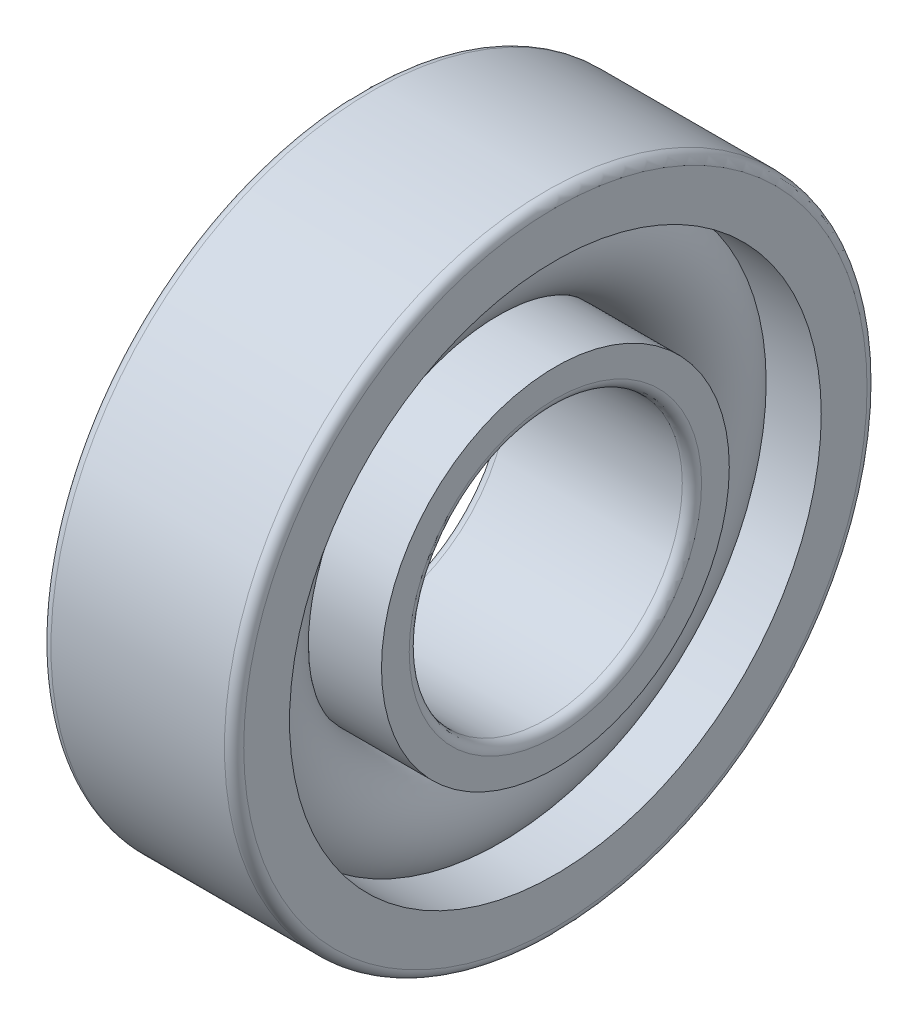
ISO-10303-21;
HEADER;
FILE_DESCRIPTION(('STEP AP214'),'2;1');
FILE_NAME('part.step','',(''),(''),'','','');
FILE_SCHEMA(('AUTOMOTIVE_DESIGN { 1 0 10303 214 1 1 1 1 }'));
ENDSEC;
DATA;
#1=APPLICATION_CONTEXT('core data for automotive mechanical design processes');
#2=APPLICATION_PROTOCOL_DEFINITION('international standard','automotive_design',2000,#1);
#3=PRODUCT_CONTEXT('',#1,'mechanical');
#4=PRODUCT('Part','Part','',(#3));
#5=PRODUCT_RELATED_PRODUCT_CATEGORY('part','',(#4));
#6=PRODUCT_DEFINITION_FORMATION('','',#4);
#7=PRODUCT_DEFINITION_CONTEXT('part definition',#1,'design');
#8=PRODUCT_DEFINITION('design','',#6,#7);
#9=PRODUCT_DEFINITION_SHAPE('','',#8);
#10=(LENGTH_UNIT() NAMED_UNIT(*) SI_UNIT(.MILLI.,.METRE.));
#11=(NAMED_UNIT(*) PLANE_ANGLE_UNIT() SI_UNIT($,.RADIAN.));
#12=(NAMED_UNIT(*) SI_UNIT($,.STERADIAN.) SOLID_ANGLE_UNIT());
#13=UNCERTAINTY_MEASURE_WITH_UNIT(LENGTH_MEASURE(1.E-05),#10,'distance_accuracy_value','');
#14=(GEOMETRIC_REPRESENTATION_CONTEXT(3) GLOBAL_UNCERTAINTY_ASSIGNED_CONTEXT((#13)) GLOBAL_UNIT_ASSIGNED_CONTEXT((#10,
#11,#12)) REPRESENTATION_CONTEXT('',''));
#15=CARTESIAN_POINT('',(0.,0.,0.));
#16=DIRECTION('',(0.,0.,1.));
#17=DIRECTION('',(1.,0.,0.));
#18=AXIS2_PLACEMENT_3D('',#15,#16,#17);
#19=CARTESIAN_POINT('',(0.,0.,0.));
#20=DIRECTION('',(-1.,0.,0.));
#21=DIRECTION('',(0.,0.,1.));
#22=AXIS2_PLACEMENT_3D('',#19,#20,#21);
#23=TOROIDAL_SURFACE('',#22,14.25,3.45);
#24=CARTESIAN_POINT('',(2.57147817412476,0.,0.));
#25=DIRECTION('',(-1.,0.,0.));
#26=DIRECTION('',(0.,0.,1.));
#27=AXIS2_PLACEMENT_3D('',#24,#25,#26);
#28=CIRCLE('',#27,16.55);
#29=CARTESIAN_POINT('',(2.57147817412476,0.,16.55));
#30=VERTEX_POINT('',#29);
#31=EDGE_CURVE('E35',#30,#30,#28,.F.);
#32=ORIENTED_EDGE('',*,*,#31,.T.);
#33=EDGE_LOOP('',(#32));
#34=FACE_BOUND('',#33,.T.);
#35=CARTESIAN_POINT('',(0.414578098794436,0.,0.));
#36=DIRECTION('',(-1.,0.,0.));
#37=DIRECTION('',(0.,0.,1.));
#38=AXIS2_PLACEMENT_3D('',#35,#36,#37);
#39=CIRCLE('',#38,10.825);
#40=CARTESIAN_POINT('',(0.414578098794436,0.,10.825));
#41=VERTEX_POINT('',#40);
#42=EDGE_CURVE('E10',#41,#41,#39,.T.);
#43=ORIENTED_EDGE('',*,*,#42,.T.);
#44=EDGE_LOOP('',(#43));
#45=FACE_BOUND('',#44,.T.);
#46=ADVANCED_FACE('F31',(#34,#45),#23,.T.);
#47=CARTESIAN_POINT('',(-20.6375,0.,0.));
#48=DIRECTION('',(1.,0.,0.));
#49=DIRECTION('',(0.,0.,-1.));
#50=AXIS2_PLACEMENT_3D('',#47,#48,#49);
#51=CYLINDRICAL_SURFACE('',#50,10.825);
#52=CARTESIAN_POINT('',(6.,0.,0.));
#53=DIRECTION('',(1.,0.,0.));
#54=DIRECTION('',(0.,0.,-1.));
#55=AXIS2_PLACEMENT_3D('',#52,#53,#54);
#56=CIRCLE('',#55,10.825);
#57=CARTESIAN_POINT('',(6.,0.,-10.825));
#58=VERTEX_POINT('',#57);
#59=EDGE_CURVE('E44',#58,#58,#56,.T.);
#60=ORIENTED_EDGE('',*,*,#59,.F.);
#61=EDGE_LOOP('',(#60));
#62=FACE_BOUND('',#61,.T.);
#63=ORIENTED_EDGE('',*,*,#42,.F.);
#64=EDGE_LOOP('',(#63));
#65=FACE_BOUND('',#64,.T.);
#66=ADVANCED_FACE('F83',(#62,#65),#51,.T.);
#67=CARTESIAN_POINT('',(-20.6375,0.,0.));
#68=DIRECTION('',(1.,0.,0.));
#69=DIRECTION('',(0.,0.,-1.));
#70=AXIS2_PLACEMENT_3D('',#67,#68,#69);
#71=CYLINDRICAL_SURFACE('',#70,11.95);
#72=CARTESIAN_POINT('',(-6.,0.,0.));
#73=DIRECTION('',(1.,0.,0.));
#74=DIRECTION('',(0.,0.,-1.));
#75=AXIS2_PLACEMENT_3D('',#72,#73,#74);
#76=CIRCLE('',#75,11.95);
#77=CARTESIAN_POINT('',(-6.,0.,-11.95));
#78=VERTEX_POINT('',#77);
#79=EDGE_CURVE('E53',#78,#78,#76,.T.);
#80=ORIENTED_EDGE('',*,*,#79,.T.);
#81=EDGE_LOOP('',(#80));
#82=FACE_BOUND('',#81,.T.);
#83=CARTESIAN_POINT('',(-2.57147817412476,0.,0.));
#84=DIRECTION('',(1.,0.,0.));
#85=DIRECTION('',(0.,0.,-1.));
#86=AXIS2_PLACEMENT_3D('',#83,#84,#85);
#87=CIRCLE('',#86,11.95);
#88=CARTESIAN_POINT('',(-2.57147817412476,0.,-11.95));
#89=VERTEX_POINT('',#88);
#90=EDGE_CURVE('E39',#89,#89,#87,.T.);
#91=ORIENTED_EDGE('',*,*,#90,.F.);
#92=EDGE_LOOP('',(#91));
#93=FACE_BOUND('',#92,.T.);
#94=ADVANCED_FACE('F86',(#82,#93),#71,.T.);
#95=CARTESIAN_POINT('',(6.,9.1,0.));
#96=DIRECTION('',(1.,0.,0.));
#97=DIRECTION('',(0.,0.,-1.));
#98=AXIS2_PLACEMENT_3D('',#95,#96,#97);
#99=PLANE('',#98);
#100=ORIENTED_EDGE('',*,*,#59,.T.);
#101=EDGE_LOOP('',(#100));
#102=FACE_BOUND('',#101,.T.);
#103=CARTESIAN_POINT('',(6.,0.,0.));
#104=DIRECTION('',(1.,0.,0.));
#105=DIRECTION('',(0.,0.,-1.));
#106=AXIS2_PLACEMENT_3D('',#103,#104,#105);
#107=CIRCLE('',#106,9.1);
#108=CARTESIAN_POINT('',(6.,0.,-9.1));
#109=VERTEX_POINT('',#108);
#110=EDGE_CURVE('E75',#109,#109,#107,.T.);
#111=ORIENTED_EDGE('',*,*,#110,.F.);
#112=EDGE_LOOP('',(#111));
#113=FACE_BOUND('',#112,.T.);
#114=ADVANCED_FACE('F80',(#102,#113),#99,.T.);
#115=CARTESIAN_POINT('',(5.4,0.,0.));
#116=DIRECTION('',(1.,0.,0.));
#117=DIRECTION('',(0.,0.,-1.));
#118=AXIS2_PLACEMENT_3D('',#115,#116,#117);
#119=TOROIDAL_SURFACE('',#118,9.1,0.6);
#120=ORIENTED_EDGE('',*,*,#110,.T.);
#121=EDGE_LOOP('',(#120));
#122=FACE_BOUND('',#121,.T.);
#123=CARTESIAN_POINT('',(5.4,0.,0.));
#124=DIRECTION('',(1.,0.,0.));
#125=DIRECTION('',(0.,0.,-1.));
#126=AXIS2_PLACEMENT_3D('',#123,#124,#125);
#127=CIRCLE('',#126,8.5);
#128=CARTESIAN_POINT('',(5.4,0.,-8.5));
#129=VERTEX_POINT('',#128);
#130=EDGE_CURVE('E72',#129,#129,#127,.T.);
#131=ORIENTED_EDGE('',*,*,#130,.F.);
#132=EDGE_LOOP('',(#131));
#133=FACE_BOUND('',#132,.T.);
#134=ADVANCED_FACE('F97',(#122,#133),#119,.T.);
#135=CARTESIAN_POINT('',(-20.6375,0.,0.));
#136=DIRECTION('',(1.,0.,0.));
#137=DIRECTION('',(0.,0.,-1.));
#138=AXIS2_PLACEMENT_3D('',#135,#136,#137);
#139=CYLINDRICAL_SURFACE('',#138,8.5);
#140=ORIENTED_EDGE('',*,*,#130,.T.);
#141=EDGE_LOOP('',(#140));
#142=FACE_BOUND('',#141,.T.);
#143=CARTESIAN_POINT('',(-5.4,0.,0.));
#144=DIRECTION('',(1.,0.,0.));
#145=DIRECTION('',(0.,0.,-1.));
#146=AXIS2_PLACEMENT_3D('',#143,#144,#145);
#147=CIRCLE('',#146,8.5);
#148=CARTESIAN_POINT('',(-5.4,0.,-8.5));
#149=VERTEX_POINT('',#148);
#150=EDGE_CURVE('E69',#149,#149,#147,.T.);
#151=ORIENTED_EDGE('',*,*,#150,.F.);
#152=EDGE_LOOP('',(#151));
#153=FACE_BOUND('',#152,.T.);
#154=ADVANCED_FACE('F100',(#142,#153),#139,.F.);
#155=CARTESIAN_POINT('',(-5.4,0.,0.));
#156=DIRECTION('',(1.,0.,0.));
#157=DIRECTION('',(0.,0.,-1.));
#158=AXIS2_PLACEMENT_3D('',#155,#156,#157);
#159=TOROIDAL_SURFACE('',#158,9.1,0.6);
#160=ORIENTED_EDGE('',*,*,#150,.T.);
#161=EDGE_LOOP('',(#160));
#162=FACE_BOUND('',#161,.T.);
#163=CARTESIAN_POINT('',(-6.,0.,0.));
#164=DIRECTION('',(1.,0.,0.));
#165=DIRECTION('',(0.,0.,-1.));
#166=AXIS2_PLACEMENT_3D('',#163,#164,#165);
#167=CIRCLE('',#166,9.1);
#168=CARTESIAN_POINT('',(-6.,0.,-9.1));
#169=VERTEX_POINT('',#168);
#170=EDGE_CURVE('E66',#169,#169,#167,.T.);
#171=ORIENTED_EDGE('',*,*,#170,.F.);
#172=EDGE_LOOP('',(#171));
#173=FACE_BOUND('',#172,.T.);
#174=ADVANCED_FACE('F104',(#162,#173),#159,.T.);
#175=CARTESIAN_POINT('',(-6.,11.95,0.));
#176=DIRECTION('',(-1.,0.,0.));
#177=DIRECTION('',(0.,0.,1.));
#178=AXIS2_PLACEMENT_3D('',#175,#176,#177);
#179=PLANE('',#178);
#180=ORIENTED_EDGE('',*,*,#170,.T.);
#181=EDGE_LOOP('',(#180));
#182=FACE_BOUND('',#181,.T.);
#183=ORIENTED_EDGE('',*,*,#79,.F.);
#184=EDGE_LOOP('',(#183));
#185=FACE_BOUND('',#184,.T.);
#186=ADVANCED_FACE('F108',(#182,#185),#179,.T.);
#187=CARTESIAN_POINT('',(-0.414578098794422,0.,0.));
#188=DIRECTION('',(1.,0.,0.));
#189=DIRECTION('',(0.,0.,-1.));
#190=AXIS2_PLACEMENT_3D('',#187,#188,#189);
#191=CIRCLE('',#190,17.675);
#192=CARTESIAN_POINT('',(-0.414578098794422,0.,-17.675));
#193=VERTEX_POINT('',#192);
#194=EDGE_CURVE('E47',#193,#193,#191,.F.);
#195=ORIENTED_EDGE('',*,*,#194,.T.);
#196=EDGE_LOOP('',(#195));
#197=FACE_BOUND('',#196,.T.);
#198=ORIENTED_EDGE('',*,*,#90,.T.);
#199=EDGE_LOOP('',(#198));
#200=FACE_BOUND('',#199,.T.);
#201=ADVANCED_FACE('F33',(#197,#200),#23,.T.);
#202=CARTESIAN_POINT('',(-20.6375,0.,0.));
#203=DIRECTION('',(1.,0.,0.));
#204=DIRECTION('',(0.,0.,-1.));
#205=AXIS2_PLACEMENT_3D('',#202,#203,#204);
#206=CYLINDRICAL_SURFACE('',#205,16.55);
#207=CARTESIAN_POINT('',(6.,0.,0.));
#208=DIRECTION('',(1.,0.,0.));
#209=DIRECTION('',(0.,0.,-1.));
#210=AXIS2_PLACEMENT_3D('',#207,#208,#209);
#211=CIRCLE('',#210,16.55);
#212=CARTESIAN_POINT('',(6.,0.,-16.55));
#213=VERTEX_POINT('',#212);
#214=EDGE_CURVE('E149',#213,#213,#211,.T.);
#215=ORIENTED_EDGE('',*,*,#214,.T.);
#216=EDGE_LOOP('',(#215));
#217=FACE_BOUND('',#216,.T.);
#218=ORIENTED_EDGE('',*,*,#31,.F.);
#219=EDGE_LOOP('',(#218));
#220=FACE_BOUND('',#219,.T.);
#221=ADVANCED_FACE('F130',(#217,#220),#206,.F.);
#222=CARTESIAN_POINT('',(-20.6375,0.,0.));
#223=DIRECTION('',(1.,0.,0.));
#224=DIRECTION('',(0.,0.,-1.));
#225=AXIS2_PLACEMENT_3D('',#222,#223,#224);
#226=CYLINDRICAL_SURFACE('',#225,17.675);
#227=CARTESIAN_POINT('',(-6.,0.,0.));
#228=DIRECTION('',(1.,0.,0.));
#229=DIRECTION('',(0.,0.,-1.));
#230=AXIS2_PLACEMENT_3D('',#227,#228,#229);
#231=CIRCLE('',#230,17.675);
#232=CARTESIAN_POINT('',(-6.,0.,-17.675));
#233=VERTEX_POINT('',#232);
#234=EDGE_CURVE('E144',#233,#233,#231,.T.);
#235=ORIENTED_EDGE('',*,*,#234,.F.);
#236=EDGE_LOOP('',(#235));
#237=FACE_BOUND('',#236,.T.);
#238=ORIENTED_EDGE('',*,*,#194,.F.);
#239=EDGE_LOOP('',(#238));
#240=FACE_BOUND('',#239,.T.);
#241=ADVANCED_FACE('F117',(#237,#240),#226,.F.);
#242=CARTESIAN_POINT('',(-5.4,0.,0.));
#243=DIRECTION('',(1.,0.,0.));
#244=DIRECTION('',(0.,0.,-1.));
#245=AXIS2_PLACEMENT_3D('',#242,#243,#244);
#246=TOROIDAL_SURFACE('',#245,19.4,0.6);
#247=CARTESIAN_POINT('',(-6.,0.,0.));
#248=DIRECTION('',(1.,0.,0.));
#249=DIRECTION('',(0.,0.,-1.));
#250=AXIS2_PLACEMENT_3D('',#247,#248,#249);
#251=CIRCLE('',#250,19.4);
#252=CARTESIAN_POINT('',(-6.,0.,-19.4));
#253=VERTEX_POINT('',#252);
#254=EDGE_CURVE('E147',#253,#253,#251,.T.);
#255=ORIENTED_EDGE('',*,*,#254,.T.);
#256=EDGE_LOOP('',(#255));
#257=FACE_BOUND('',#256,.T.);
#258=CARTESIAN_POINT('',(-5.4,0.,0.));
#259=DIRECTION('',(1.,0.,0.));
#260=DIRECTION('',(0.,0.,-1.));
#261=AXIS2_PLACEMENT_3D('',#258,#259,#260);
#262=CIRCLE('',#261,20.);
#263=CARTESIAN_POINT('',(-5.4,0.,-20.));
#264=VERTEX_POINT('',#263);
#265=EDGE_CURVE('E49',#264,#264,#262,.T.);
#266=ORIENTED_EDGE('',*,*,#265,.F.);
#267=EDGE_LOOP('',(#266));
#268=FACE_BOUND('',#267,.T.);
#269=ADVANCED_FACE('F113',(#257,#268),#246,.T.);
#270=CARTESIAN_POINT('',(-20.6375,0.,0.));
#271=DIRECTION('',(1.,0.,0.));
#272=DIRECTION('',(0.,0.,-1.));
#273=AXIS2_PLACEMENT_3D('',#270,#271,#272);
#274=CYLINDRICAL_SURFACE('',#273,20.);
#275=ORIENTED_EDGE('',*,*,#265,.T.);
#276=EDGE_LOOP('',(#275));
#277=FACE_BOUND('',#276,.T.);
#278=CARTESIAN_POINT('',(5.4,0.,0.));
#279=DIRECTION('',(1.,0.,0.));
#280=DIRECTION('',(0.,0.,-1.));
#281=AXIS2_PLACEMENT_3D('',#278,#279,#280);
#282=CIRCLE('',#281,20.);
#283=CARTESIAN_POINT('',(5.4,0.,-20.));
#284=VERTEX_POINT('',#283);
#285=EDGE_CURVE('E55',#284,#284,#282,.T.);
#286=ORIENTED_EDGE('',*,*,#285,.F.);
#287=EDGE_LOOP('',(#286));
#288=FACE_BOUND('',#287,.T.);
#289=ADVANCED_FACE('F116',(#277,#288),#274,.T.);
#290=CARTESIAN_POINT('',(5.4,0.,0.));
#291=DIRECTION('',(1.,0.,0.));
#292=DIRECTION('',(0.,0.,-1.));
#293=AXIS2_PLACEMENT_3D('',#290,#291,#292);
#294=TOROIDAL_SURFACE('',#293,19.4,0.6);
#295=ORIENTED_EDGE('',*,*,#285,.T.);
#296=EDGE_LOOP('',(#295));
#297=FACE_BOUND('',#296,.T.);
#298=CARTESIAN_POINT('',(6.,0.,0.));
#299=DIRECTION('',(1.,0.,0.));
#300=DIRECTION('',(0.,0.,-1.));
#301=AXIS2_PLACEMENT_3D('',#298,#299,#300);
#302=CIRCLE('',#301,19.4);
#303=CARTESIAN_POINT('',(6.,0.,-19.4));
#304=VERTEX_POINT('',#303);
#305=EDGE_CURVE('E60',#304,#304,#302,.T.);
#306=ORIENTED_EDGE('',*,*,#305,.F.);
#307=EDGE_LOOP('',(#306));
#308=FACE_BOUND('',#307,.T.);
#309=ADVANCED_FACE('F121',(#297,#308),#294,.T.);
#310=CARTESIAN_POINT('',(6.,19.4,0.));
#311=DIRECTION('',(1.,0.,0.));
#312=DIRECTION('',(0.,0.,-1.));
#313=AXIS2_PLACEMENT_3D('',#310,#311,#312);
#314=PLANE('',#313);
#315=ORIENTED_EDGE('',*,*,#305,.T.);
#316=EDGE_LOOP('',(#315));
#317=FACE_BOUND('',#316,.T.);
#318=ORIENTED_EDGE('',*,*,#214,.F.);
#319=EDGE_LOOP('',(#318));
#320=FACE_BOUND('',#319,.T.);
#321=ADVANCED_FACE('F124',(#317,#320),#314,.T.);
#322=CARTESIAN_POINT('',(-6.,17.675,0.));
#323=DIRECTION('',(-1.,0.,0.));
#324=DIRECTION('',(0.,0.,1.));
#325=AXIS2_PLACEMENT_3D('',#322,#323,#324);
#326=PLANE('',#325);
#327=ORIENTED_EDGE('',*,*,#234,.T.);
#328=EDGE_LOOP('',(#327));
#329=FACE_BOUND('',#328,.T.);
#330=ORIENTED_EDGE('',*,*,#254,.F.);
#331=EDGE_LOOP('',(#330));
#332=FACE_BOUND('',#331,.T.);
#333=ADVANCED_FACE('F128',(#329,#332),#326,.T.);
#334=CLOSED_SHELL('',(#46,#66,#94,#114,#134,#154,#174,#186,#201,#221,#241,#269,#289,#309,#321,#333));
#335=MANIFOLD_SOLID_BREP('B2',#334);
#336=ADVANCED_BREP_SHAPE_REPRESENTATION('',(#18,#335),#14);
#337=SHAPE_DEFINITION_REPRESENTATION(#9,#336);
ENDSEC;
END-ISO-10303-21;
